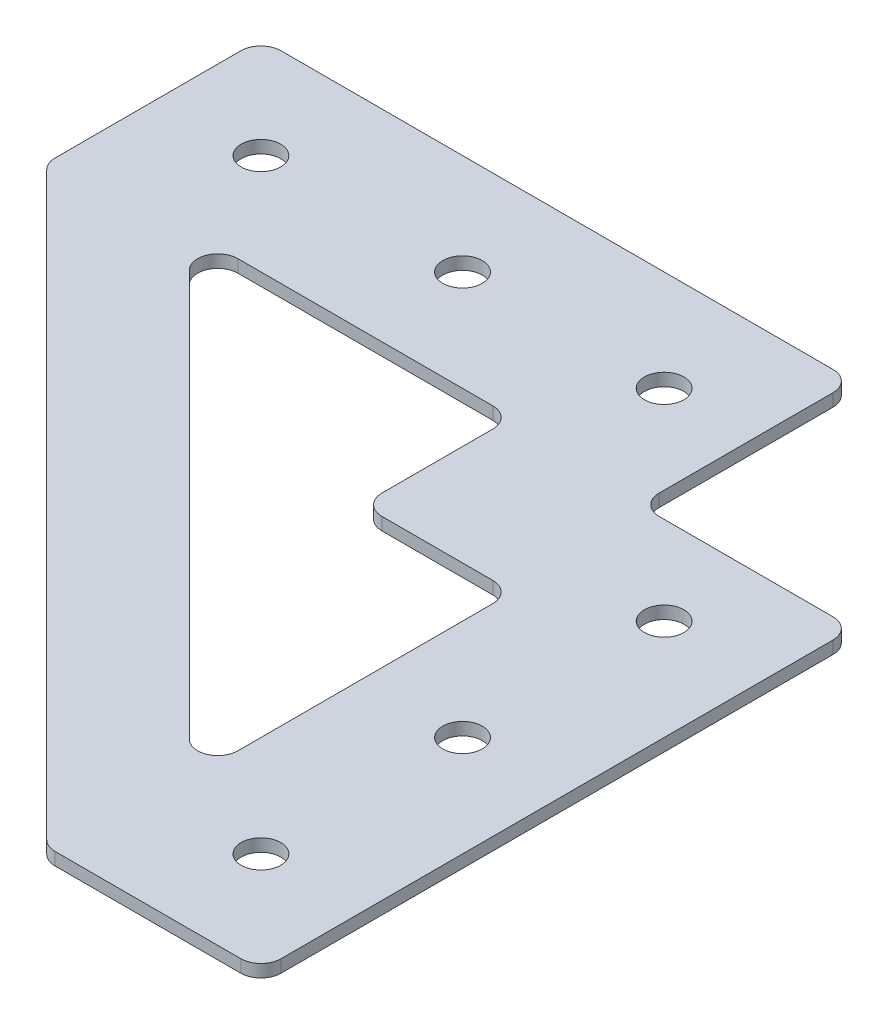
ISO-10303-21;
HEADER;
FILE_DESCRIPTION(('STEP AP214'),'2;1');
FILE_NAME('part.step','',(''),(''),'','','');
FILE_SCHEMA(('AUTOMOTIVE_DESIGN { 1 0 10303 214 1 1 1 1 }'));
ENDSEC;
DATA;
#1=APPLICATION_CONTEXT('core data for automotive mechanical design processes');
#2=APPLICATION_PROTOCOL_DEFINITION('international standard','automotive_design',2000,#1);
#3=PRODUCT_CONTEXT('',#1,'mechanical');
#4=PRODUCT('Part','Part','',(#3));
#5=PRODUCT_RELATED_PRODUCT_CATEGORY('part','',(#4));
#6=PRODUCT_DEFINITION_FORMATION('','',#4);
#7=PRODUCT_DEFINITION_CONTEXT('part definition',#1,'design');
#8=PRODUCT_DEFINITION('design','',#6,#7);
#9=PRODUCT_DEFINITION_SHAPE('','',#8);
#10=(LENGTH_UNIT() NAMED_UNIT(*) SI_UNIT(.MILLI.,.METRE.));
#11=(NAMED_UNIT(*) PLANE_ANGLE_UNIT() SI_UNIT($,.RADIAN.));
#12=(NAMED_UNIT(*) SI_UNIT($,.STERADIAN.) SOLID_ANGLE_UNIT());
#13=UNCERTAINTY_MEASURE_WITH_UNIT(LENGTH_MEASURE(1.E-05),#10,'distance_accuracy_value','');
#14=(GEOMETRIC_REPRESENTATION_CONTEXT(3) GLOBAL_UNCERTAINTY_ASSIGNED_CONTEXT((#13)) GLOBAL_UNIT_ASSIGNED_CONTEXT((#10,
#11,#12)) REPRESENTATION_CONTEXT('',''));
#15=CARTESIAN_POINT('',(0.,0.,0.));
#16=DIRECTION('',(0.,0.,1.));
#17=DIRECTION('',(1.,0.,0.));
#18=AXIS2_PLACEMENT_3D('',#15,#16,#17);
#19=CARTESIAN_POINT('',(-12.7,0.,38.1));
#20=DIRECTION('',(0.,1.,0.));
#21=DIRECTION('',(0.,0.,1.));
#22=AXIS2_PLACEMENT_3D('',#19,#20,#21);
#23=CYLINDRICAL_SURFACE('',#22,2.4892);
#24=CARTESIAN_POINT('',(-12.7,0.,38.1));
#25=DIRECTION('',(0.,1.,0.));
#26=DIRECTION('',(0.,0.,1.));
#27=AXIS2_PLACEMENT_3D('',#24,#25,#26);
#28=CIRCLE('',#27,2.4892);
#29=CARTESIAN_POINT('',(-12.7,0.,40.5892));
#30=VERTEX_POINT('',#29);
#31=EDGE_CURVE('E44',#30,#30,#28,.T.);
#32=ORIENTED_EDGE('',*,*,#31,.F.);
#33=EDGE_LOOP('',(#32));
#34=FACE_BOUND('',#33,.T.);
#35=CARTESIAN_POINT('',(-12.7,1.5875,38.1));
#36=DIRECTION('',(0.,1.,0.));
#37=DIRECTION('',(0.,0.,1.));
#38=AXIS2_PLACEMENT_3D('',#35,#36,#37);
#39=CIRCLE('',#38,2.4892);
#40=CARTESIAN_POINT('',(-12.7,1.5875,40.5892));
#41=VERTEX_POINT('',#40);
#42=EDGE_CURVE('E11',#41,#41,#39,.T.);
#43=ORIENTED_EDGE('',*,*,#42,.T.);
#44=EDGE_LOOP('',(#43));
#45=FACE_BOUND('',#44,.T.);
#46=ADVANCED_FACE('F37',(#34,#45),#23,.F.);
#47=CARTESIAN_POINT('',(-12.7,0.,63.5));
#48=DIRECTION('',(0.,1.,0.));
#49=DIRECTION('',(0.,0.,1.));
#50=AXIS2_PLACEMENT_3D('',#47,#48,#49);
#51=CYLINDRICAL_SURFACE('',#50,2.4892);
#52=CARTESIAN_POINT('',(-12.7,0.,63.5));
#53=DIRECTION('',(0.,1.,0.));
#54=DIRECTION('',(0.,0.,1.));
#55=AXIS2_PLACEMENT_3D('',#52,#53,#54);
#56=CIRCLE('',#55,2.4892);
#57=CARTESIAN_POINT('',(-12.7,0.,65.9892));
#58=VERTEX_POINT('',#57);
#59=EDGE_CURVE('E343',#58,#58,#56,.T.);
#60=ORIENTED_EDGE('',*,*,#59,.F.);
#61=EDGE_LOOP('',(#60));
#62=FACE_BOUND('',#61,.T.);
#63=CARTESIAN_POINT('',(-12.7,1.5875,63.5));
#64=DIRECTION('',(0.,1.,0.));
#65=DIRECTION('',(0.,0.,1.));
#66=AXIS2_PLACEMENT_3D('',#63,#64,#65);
#67=CIRCLE('',#66,2.4892);
#68=CARTESIAN_POINT('',(-12.7,1.5875,65.9892));
#69=VERTEX_POINT('',#68);
#70=EDGE_CURVE('E346',#69,#69,#67,.T.);
#71=ORIENTED_EDGE('',*,*,#70,.T.);
#72=EDGE_LOOP('',(#71));
#73=FACE_BOUND('',#72,.T.);
#74=ADVANCED_FACE('F355',(#62,#73),#51,.F.);
#75=CARTESIAN_POINT('',(-38.1,0.,12.7));
#76=DIRECTION('',(0.,1.,0.));
#77=DIRECTION('',(0.,0.,1.));
#78=AXIS2_PLACEMENT_3D('',#75,#76,#77);
#79=CYLINDRICAL_SURFACE('',#78,2.4892);
#80=CARTESIAN_POINT('',(-38.1,0.,12.7));
#81=DIRECTION('',(0.,1.,0.));
#82=DIRECTION('',(0.,0.,1.));
#83=AXIS2_PLACEMENT_3D('',#80,#81,#82);
#84=CIRCLE('',#83,2.4892);
#85=CARTESIAN_POINT('',(-38.1,0.,15.1892));
#86=VERTEX_POINT('',#85);
#87=EDGE_CURVE('E337',#86,#86,#84,.T.);
#88=ORIENTED_EDGE('',*,*,#87,.F.);
#89=EDGE_LOOP('',(#88));
#90=FACE_BOUND('',#89,.T.);
#91=CARTESIAN_POINT('',(-38.1,1.5875,12.7));
#92=DIRECTION('',(0.,1.,0.));
#93=DIRECTION('',(0.,0.,1.));
#94=AXIS2_PLACEMENT_3D('',#91,#92,#93);
#95=CIRCLE('',#94,2.4892);
#96=CARTESIAN_POINT('',(-38.1,1.5875,15.1892));
#97=VERTEX_POINT('',#96);
#98=EDGE_CURVE('E340',#97,#97,#95,.T.);
#99=ORIENTED_EDGE('',*,*,#98,.T.);
#100=EDGE_LOOP('',(#99));
#101=FACE_BOUND('',#100,.T.);
#102=ADVANCED_FACE('F549',(#90,#101),#79,.F.);
#103=CARTESIAN_POINT('',(-63.5,0.,12.7));
#104=DIRECTION('',(0.,1.,0.));
#105=DIRECTION('',(0.,0.,1.));
#106=AXIS2_PLACEMENT_3D('',#103,#104,#105);
#107=CYLINDRICAL_SURFACE('',#106,2.4892);
#108=CARTESIAN_POINT('',(-63.5,0.,12.7));
#109=DIRECTION('',(0.,1.,0.));
#110=DIRECTION('',(0.,0.,1.));
#111=AXIS2_PLACEMENT_3D('',#108,#109,#110);
#112=CIRCLE('',#111,2.4892);
#113=CARTESIAN_POINT('',(-63.5,0.,15.1892));
#114=VERTEX_POINT('',#113);
#115=EDGE_CURVE('E331',#114,#114,#112,.T.);
#116=ORIENTED_EDGE('',*,*,#115,.F.);
#117=EDGE_LOOP('',(#116));
#118=FACE_BOUND('',#117,.T.);
#119=CARTESIAN_POINT('',(-63.5,1.5875,12.7));
#120=DIRECTION('',(0.,1.,0.));
#121=DIRECTION('',(0.,0.,1.));
#122=AXIS2_PLACEMENT_3D('',#119,#120,#121);
#123=CIRCLE('',#122,2.4892);
#124=CARTESIAN_POINT('',(-63.5,1.5875,15.1892));
#125=VERTEX_POINT('',#124);
#126=EDGE_CURVE('E334',#125,#125,#123,.T.);
#127=ORIENTED_EDGE('',*,*,#126,.T.);
#128=EDGE_LOOP('',(#127));
#129=FACE_BOUND('',#128,.T.);
#130=ADVANCED_FACE('F361',(#118,#129),#107,.F.);
#131=CARTESIAN_POINT('',(0.,1.5875,0.));
#132=DIRECTION('',(0.,-1.,0.));
#133=DIRECTION('',(0.,0.,-1.));
#134=AXIS2_PLACEMENT_3D('',#131,#132,#133);
#135=PLANE('',#134);
#136=ORIENTED_EDGE('',*,*,#42,.F.);
#137=EDGE_LOOP('',(#136));
#138=FACE_BOUND('',#137,.T.);
#139=ORIENTED_EDGE('',*,*,#70,.F.);
#140=EDGE_LOOP('',(#139));
#141=FACE_BOUND('',#140,.T.);
#142=ORIENTED_EDGE('',*,*,#98,.F.);
#143=EDGE_LOOP('',(#142));
#144=FACE_BOUND('',#143,.T.);
#145=ORIENTED_EDGE('',*,*,#126,.F.);
#146=EDGE_LOOP('',(#145));
#147=FACE_BOUND('',#146,.T.);
#148=CARTESIAN_POINT('',(-88.9,1.5875,12.7));
#149=DIRECTION('',(0.,1.,0.));
#150=DIRECTION('',(0.,0.,1.));
#151=AXIS2_PLACEMENT_3D('',#148,#149,#150);
#152=CIRCLE('',#151,2.4892);
#153=CARTESIAN_POINT('',(-88.9,1.5875,15.1892));
#154=VERTEX_POINT('',#153);
#155=EDGE_CURVE('E372',#154,#154,#152,.T.);
#156=ORIENTED_EDGE('',*,*,#155,.F.);
#157=EDGE_LOOP('',(#156));
#158=FACE_BOUND('',#157,.T.);
#159=CARTESIAN_POINT('',(-12.7,1.5875,88.9));
#160=DIRECTION('',(0.,1.,0.));
#161=DIRECTION('',(0.,0.,1.));
#162=AXIS2_PLACEMENT_3D('',#159,#160,#161);
#163=CIRCLE('',#162,2.4892);
#164=CARTESIAN_POINT('',(-12.7,1.5875,91.3892));
#165=VERTEX_POINT('',#164);
#166=EDGE_CURVE('E375',#165,#165,#163,.T.);
#167=ORIENTED_EDGE('',*,*,#166,.F.);
#168=EDGE_LOOP('',(#167));
#169=FACE_BOUND('',#168,.T.);
#170=DIRECTION('',(0.,0.,-1.));
#171=VECTOR('',#170,1.);
#172=CARTESIAN_POINT('',(0.,1.5875,26.9875));
#173=LINE('',#172,#171);
#174=CARTESIAN_POINT('',(0.,1.5875,99.06));
#175=VERTEX_POINT('',#174);
#176=CARTESIAN_POINT('',(0.,1.5875,29.5275));
#177=VERTEX_POINT('',#176);
#178=EDGE_CURVE('E230',#175,#177,#173,.T.);
#179=ORIENTED_EDGE('',*,*,#178,.T.);
#180=CARTESIAN_POINT('',(-2.54,1.5875,29.5275));
#181=DIRECTION('',(0.,-1.,0.));
#182=DIRECTION('',(0.,0.,-1.));
#183=AXIS2_PLACEMENT_3D('',#180,#181,#182);
#184=CIRCLE('',#183,2.54);
#185=CARTESIAN_POINT('',(-2.54,1.5875,26.9875));
#186=VERTEX_POINT('',#185);
#187=EDGE_CURVE('E58',#177,#186,#184,.F.);
#188=ORIENTED_EDGE('',*,*,#187,.T.);
#189=DIRECTION('',(-1.,0.,0.));
#190=VECTOR('',#189,1.);
#191=CARTESIAN_POINT('',(0.,1.5875,26.9875));
#192=LINE('',#191,#190);
#193=CARTESIAN_POINT('',(-24.4475,1.5875,26.9875));
#194=VERTEX_POINT('',#193);
#195=EDGE_CURVE('E226',#186,#194,#192,.T.);
#196=ORIENTED_EDGE('',*,*,#195,.T.);
#197=CARTESIAN_POINT('',(-24.4475,1.5875,24.4475));
#198=DIRECTION('',(0.,-1.,0.));
#199=DIRECTION('',(0.,0.,-1.));
#200=AXIS2_PLACEMENT_3D('',#197,#198,#199);
#201=CIRCLE('',#200,2.54);
#202=CARTESIAN_POINT('',(-26.9875,1.5875,24.4475));
#203=VERTEX_POINT('',#202);
#204=EDGE_CURVE('E329',#194,#203,#201,.T.);
#205=ORIENTED_EDGE('',*,*,#204,.T.);
#206=DIRECTION('',(0.,0.,-1.));
#207=VECTOR('',#206,1.);
#208=CARTESIAN_POINT('',(-26.9875,1.5875,0.));
#209=LINE('',#208,#207);
#210=CARTESIAN_POINT('',(-26.9875,1.5875,2.54));
#211=VERTEX_POINT('',#210);
#212=EDGE_CURVE('E405',#203,#211,#209,.T.);
#213=ORIENTED_EDGE('',*,*,#212,.T.);
#214=CARTESIAN_POINT('',(-29.5275,1.5875,2.54));
#215=DIRECTION('',(0.,-1.,0.));
#216=DIRECTION('',(0.,0.,-1.));
#217=AXIS2_PLACEMENT_3D('',#214,#215,#216);
#218=CIRCLE('',#217,2.54);
#219=CARTESIAN_POINT('',(-29.5275,1.5875,0.));
#220=VERTEX_POINT('',#219);
#221=EDGE_CURVE('E270',#211,#220,#218,.F.);
#222=ORIENTED_EDGE('',*,*,#221,.T.);
#223=DIRECTION('',(-1.,0.,0.));
#224=VECTOR('',#223,1.);
#225=CARTESIAN_POINT('',(-26.9875,1.5875,0.));
#226=LINE('',#225,#224);
#227=CARTESIAN_POINT('',(-99.06,1.5875,0.));
#228=VERTEX_POINT('',#227);
#229=EDGE_CURVE('E408',#220,#228,#226,.T.);
#230=ORIENTED_EDGE('',*,*,#229,.T.);
#231=CARTESIAN_POINT('',(-99.06,1.5875,2.54));
#232=DIRECTION('',(0.,-1.,0.));
#233=DIRECTION('',(0.,0.,-1.));
#234=AXIS2_PLACEMENT_3D('',#231,#232,#233);
#235=CIRCLE('',#234,2.54);
#236=CARTESIAN_POINT('',(-101.6,1.5875,2.54));
#237=VERTEX_POINT('',#236);
#238=EDGE_CURVE('E272',#228,#237,#235,.F.);
#239=ORIENTED_EDGE('',*,*,#238,.T.);
#240=DIRECTION('',(0.,0.,1.));
#241=VECTOR('',#240,1.);
#242=CARTESIAN_POINT('',(-101.6,1.5875,0.));
#243=LINE('',#242,#241);
#244=CARTESIAN_POINT('',(-101.6,1.5875,25.9353975515723));
#245=VERTEX_POINT('',#244);
#246=EDGE_CURVE('E411',#237,#245,#243,.T.);
#247=ORIENTED_EDGE('',*,*,#246,.T.);
#248=CARTESIAN_POINT('',(-99.06,1.5875,25.9353975515723));
#249=DIRECTION('',(0.,-1.,0.));
#250=DIRECTION('',(0.,0.,-1.));
#251=AXIS2_PLACEMENT_3D('',#248,#249,#250);
#252=CIRCLE('',#251,2.54);
#253=CARTESIAN_POINT('',(-100.856051224214,1.5875,27.7314487757862));
#254=VERTEX_POINT('',#253);
#255=EDGE_CURVE('E274',#245,#254,#252,.F.);
#256=ORIENTED_EDGE('',*,*,#255,.T.);
#257=DIRECTION('',(0.707106781186548,0.,0.707106781186547));
#258=VECTOR('',#257,1.);
#259=CARTESIAN_POINT('',(-101.6,1.5875,26.9875));
#260=LINE('',#259,#258);
#261=CARTESIAN_POINT('',(-27.7314487757861,1.5875,100.856051224214));
#262=VERTEX_POINT('',#261);
#263=EDGE_CURVE('E414',#254,#262,#260,.T.);
#264=ORIENTED_EDGE('',*,*,#263,.T.);
#265=CARTESIAN_POINT('',(-25.9353975515723,1.5875,99.06));
#266=DIRECTION('',(0.,-1.,0.));
#267=DIRECTION('',(0.,0.,-1.));
#268=AXIS2_PLACEMENT_3D('',#265,#266,#267);
#269=CIRCLE('',#268,2.54);
#270=CARTESIAN_POINT('',(-25.9353975515723,1.5875,101.6));
#271=VERTEX_POINT('',#270);
#272=EDGE_CURVE('E276',#262,#271,#269,.F.);
#273=ORIENTED_EDGE('',*,*,#272,.T.);
#274=DIRECTION('',(1.,0.,0.));
#275=VECTOR('',#274,1.);
#276=CARTESIAN_POINT('',(0.,1.5875,101.6));
#277=LINE('',#276,#275);
#278=CARTESIAN_POINT('',(-2.53999999999999,1.5875,101.6));
#279=VERTEX_POINT('',#278);
#280=EDGE_CURVE('E417',#271,#279,#277,.T.);
#281=ORIENTED_EDGE('',*,*,#280,.T.);
#282=CARTESIAN_POINT('',(-2.53999999999999,1.5875,99.06));
#283=DIRECTION('',(0.,-1.,0.));
#284=DIRECTION('',(0.,0.,-1.));
#285=AXIS2_PLACEMENT_3D('',#282,#283,#284);
#286=CIRCLE('',#285,2.54);
#287=EDGE_CURVE('E268',#279,#175,#286,.F.);
#288=ORIENTED_EDGE('',*,*,#287,.T.);
#289=EDGE_LOOP('',(#179,#188,#196,#205,#213,#222,#230,#239,#247,#256,#264,#273,#281,#288));
#290=FACE_BOUND('',#289,.T.);
#291=DIRECTION('',(0.,0.,-1.));
#292=VECTOR('',#291,1.);
#293=CARTESIAN_POINT('',(-44.45,1.5875,25.4));
#294=LINE('',#293,#292);
#295=CARTESIAN_POINT('',(-44.45,1.5875,41.91));
#296=VERTEX_POINT('',#295);
#297=CARTESIAN_POINT('',(-44.45,1.5875,27.94));
#298=VERTEX_POINT('',#297);
#299=EDGE_CURVE('E380',#296,#298,#294,.T.);
#300=ORIENTED_EDGE('',*,*,#299,.F.);
#301=CARTESIAN_POINT('',(-41.91,1.5875,41.91));
#302=DIRECTION('',(0.,-1.,0.));
#303=DIRECTION('',(0.,0.,-1.));
#304=AXIS2_PLACEMENT_3D('',#301,#302,#303);
#305=CIRCLE('',#304,2.54);
#306=CARTESIAN_POINT('',(-41.91,1.5875,44.45));
#307=VERTEX_POINT('',#306);
#308=EDGE_CURVE('E279',#296,#307,#305,.F.);
#309=ORIENTED_EDGE('',*,*,#308,.T.);
#310=DIRECTION('',(-1.,0.,0.));
#311=VECTOR('',#310,1.);
#312=CARTESIAN_POINT('',(-25.4,1.5875,44.45));
#313=LINE('',#312,#311);
#314=CARTESIAN_POINT('',(-27.94,1.5875,44.45));
#315=VERTEX_POINT('',#314);
#316=EDGE_CURVE('E386',#315,#307,#313,.T.);
#317=ORIENTED_EDGE('',*,*,#316,.F.);
#318=CARTESIAN_POINT('',(-27.94,1.5875,46.99));
#319=DIRECTION('',(0.,-1.,0.));
#320=DIRECTION('',(0.,0.,-1.));
#321=AXIS2_PLACEMENT_3D('',#318,#319,#320);
#322=CIRCLE('',#321,2.54);
#323=CARTESIAN_POINT('',(-25.4,1.5875,46.99));
#324=VERTEX_POINT('',#323);
#325=EDGE_CURVE('E211',#315,#324,#322,.T.);
#326=ORIENTED_EDGE('',*,*,#325,.T.);
#327=DIRECTION('',(0.,0.,-1.));
#328=VECTOR('',#327,1.);
#329=CARTESIAN_POINT('',(-25.4,1.5875,44.45));
#330=LINE('',#329,#328);
#331=CARTESIAN_POINT('',(-25.4,1.5875,79.094885309434));
#332=VERTEX_POINT('',#331);
#333=EDGE_CURVE('E580',#332,#324,#330,.T.);
#334=ORIENTED_EDGE('',*,*,#333,.F.);
#335=CARTESIAN_POINT('',(-27.94,1.5875,79.094885309434));
#336=DIRECTION('',(0.,-1.,0.));
#337=DIRECTION('',(0.,0.,-1.));
#338=AXIS2_PLACEMENT_3D('',#335,#336,#337);
#339=CIRCLE('',#338,2.54);
#340=CARTESIAN_POINT('',(-29.7360512242138,1.5875,80.8909365336479));
#341=VERTEX_POINT('',#340);
#342=EDGE_CURVE('E321',#332,#341,#339,.T.);
#343=ORIENTED_EDGE('',*,*,#342,.T.);
#344=DIRECTION('',(0.707106781186548,0.,0.707106781186547));
#345=VECTOR('',#344,1.);
#346=CARTESIAN_POINT('',(-85.2269877578617,1.5875,25.4));
#347=LINE('',#346,#345);
#348=CARTESIAN_POINT('',(-80.8909365336479,1.5875,29.7360512242138));
#349=VERTEX_POINT('',#348);
#350=EDGE_CURVE('E577',#349,#341,#347,.T.);
#351=ORIENTED_EDGE('',*,*,#350,.F.);
#352=CARTESIAN_POINT('',(-79.094885309434,1.5875,27.94));
#353=DIRECTION('',(0.,-1.,0.));
#354=DIRECTION('',(0.,0.,-1.));
#355=AXIS2_PLACEMENT_3D('',#352,#353,#354);
#356=CIRCLE('',#355,2.54);
#357=CARTESIAN_POINT('',(-79.094885309434,1.5875,25.4));
#358=VERTEX_POINT('',#357);
#359=EDGE_CURVE('E317',#349,#358,#356,.T.);
#360=ORIENTED_EDGE('',*,*,#359,.T.);
#361=DIRECTION('',(-1.,0.,0.));
#362=VECTOR('',#361,1.);
#363=CARTESIAN_POINT('',(-44.45,1.5875,25.4));
#364=LINE('',#363,#362);
#365=CARTESIAN_POINT('',(-46.99,1.5875,25.4));
#366=VERTEX_POINT('',#365);
#367=EDGE_CURVE('E400',#366,#358,#364,.T.);
#368=ORIENTED_EDGE('',*,*,#367,.F.);
#369=CARTESIAN_POINT('',(-46.99,1.5875,27.94));
#370=DIRECTION('',(0.,-1.,0.));
#371=DIRECTION('',(0.,0.,-1.));
#372=AXIS2_PLACEMENT_3D('',#369,#370,#371);
#373=CIRCLE('',#372,2.54);
#374=EDGE_CURVE('E210',#366,#298,#373,.T.);
#375=ORIENTED_EDGE('',*,*,#374,.T.);
#376=EDGE_LOOP('',(#300,#309,#317,#326,#334,#343,#351,#360,#368,#375));
#377=FACE_BOUND('',#376,.T.);
#378=ADVANCED_FACE('F358',(#138,#141,#144,#147,#158,#169,#290,#377),#135,.F.);
#379=CARTESIAN_POINT('',(0.,0.,0.));
#380=DIRECTION('',(0.,-1.,0.));
#381=DIRECTION('',(0.,0.,-1.));
#382=AXIS2_PLACEMENT_3D('',#379,#380,#381);
#383=PLANE('',#382);
#384=ORIENTED_EDGE('',*,*,#31,.T.);
#385=EDGE_LOOP('',(#384));
#386=FACE_BOUND('',#385,.T.);
#387=ORIENTED_EDGE('',*,*,#59,.T.);
#388=EDGE_LOOP('',(#387));
#389=FACE_BOUND('',#388,.T.);
#390=ORIENTED_EDGE('',*,*,#87,.T.);
#391=EDGE_LOOP('',(#390));
#392=FACE_BOUND('',#391,.T.);
#393=ORIENTED_EDGE('',*,*,#115,.T.);
#394=EDGE_LOOP('',(#393));
#395=FACE_BOUND('',#394,.T.);
#396=CARTESIAN_POINT('',(-88.9,0.,12.7));
#397=DIRECTION('',(0.,1.,0.));
#398=DIRECTION('',(0.,0.,1.));
#399=AXIS2_PLACEMENT_3D('',#396,#397,#398);
#400=CIRCLE('',#399,2.4892);
#401=CARTESIAN_POINT('',(-88.9,0.,15.1892));
#402=VERTEX_POINT('',#401);
#403=EDGE_CURVE('E222',#402,#402,#400,.T.);
#404=ORIENTED_EDGE('',*,*,#403,.T.);
#405=EDGE_LOOP('',(#404));
#406=FACE_BOUND('',#405,.T.);
#407=CARTESIAN_POINT('',(-12.7,0.,88.9));
#408=DIRECTION('',(0.,1.,0.));
#409=DIRECTION('',(0.,0.,1.));
#410=AXIS2_PLACEMENT_3D('',#407,#408,#409);
#411=CIRCLE('',#410,2.4892);
#412=CARTESIAN_POINT('',(-12.7,0.,91.3892));
#413=VERTEX_POINT('',#412);
#414=EDGE_CURVE('E569',#413,#413,#411,.T.);
#415=ORIENTED_EDGE('',*,*,#414,.T.);
#416=EDGE_LOOP('',(#415));
#417=FACE_BOUND('',#416,.T.);
#418=DIRECTION('',(-1.,0.,0.));
#419=VECTOR('',#418,1.);
#420=CARTESIAN_POINT('',(0.,0.,26.9875));
#421=LINE('',#420,#419);
#422=CARTESIAN_POINT('',(-2.54,0.,26.9875));
#423=VERTEX_POINT('',#422);
#424=CARTESIAN_POINT('',(-24.4475,0.,26.9875));
#425=VERTEX_POINT('',#424);
#426=EDGE_CURVE('E233',#423,#425,#421,.T.);
#427=ORIENTED_EDGE('',*,*,#426,.F.);
#428=CARTESIAN_POINT('',(-2.54,0.,29.5275));
#429=DIRECTION('',(0.,-1.,0.));
#430=DIRECTION('',(0.,0.,-1.));
#431=AXIS2_PLACEMENT_3D('',#428,#429,#430);
#432=CIRCLE('',#431,2.54);
#433=CARTESIAN_POINT('',(0.,0.,29.5275));
#434=VERTEX_POINT('',#433);
#435=EDGE_CURVE('E260',#423,#434,#432,.T.);
#436=ORIENTED_EDGE('',*,*,#435,.T.);
#437=DIRECTION('',(0.,0.,-1.));
#438=VECTOR('',#437,1.);
#439=CARTESIAN_POINT('',(0.,0.,26.9875));
#440=LINE('',#439,#438);
#441=CARTESIAN_POINT('',(0.,0.,99.06));
#442=VERTEX_POINT('',#441);
#443=EDGE_CURVE('E434',#442,#434,#440,.T.);
#444=ORIENTED_EDGE('',*,*,#443,.F.);
#445=CARTESIAN_POINT('',(-2.53999999999999,0.,99.06));
#446=DIRECTION('',(0.,-1.,0.));
#447=DIRECTION('',(0.,0.,-1.));
#448=AXIS2_PLACEMENT_3D('',#445,#446,#447);
#449=CIRCLE('',#448,2.54);
#450=CARTESIAN_POINT('',(-2.53999999999999,0.,101.6));
#451=VERTEX_POINT('',#450);
#452=EDGE_CURVE('E250',#442,#451,#449,.T.);
#453=ORIENTED_EDGE('',*,*,#452,.T.);
#454=DIRECTION('',(1.,0.,0.));
#455=VECTOR('',#454,1.);
#456=CARTESIAN_POINT('',(0.,0.,101.6));
#457=LINE('',#456,#455);
#458=CARTESIAN_POINT('',(-25.9353975515723,0.,101.6));
#459=VERTEX_POINT('',#458);
#460=EDGE_CURVE('E432',#459,#451,#457,.T.);
#461=ORIENTED_EDGE('',*,*,#460,.F.);
#462=CARTESIAN_POINT('',(-25.9353975515723,0.,99.06));
#463=DIRECTION('',(0.,-1.,0.));
#464=DIRECTION('',(0.,0.,-1.));
#465=AXIS2_PLACEMENT_3D('',#462,#463,#464);
#466=CIRCLE('',#465,2.54);
#467=CARTESIAN_POINT('',(-27.7314487757861,0.,100.856051224214));
#468=VERTEX_POINT('',#467);
#469=EDGE_CURVE('E258',#459,#468,#466,.T.);
#470=ORIENTED_EDGE('',*,*,#469,.T.);
#471=DIRECTION('',(0.707106781186548,0.,0.707106781186547));
#472=VECTOR('',#471,1.);
#473=CARTESIAN_POINT('',(-101.6,0.,26.9875));
#474=LINE('',#473,#472);
#475=CARTESIAN_POINT('',(-100.856051224214,0.,27.7314487757862));
#476=VERTEX_POINT('',#475);
#477=EDGE_CURVE('E429',#476,#468,#474,.T.);
#478=ORIENTED_EDGE('',*,*,#477,.F.);
#479=CARTESIAN_POINT('',(-99.06,0.,25.9353975515723));
#480=DIRECTION('',(0.,-1.,0.));
#481=DIRECTION('',(0.,0.,-1.));
#482=AXIS2_PLACEMENT_3D('',#479,#480,#481);
#483=CIRCLE('',#482,2.54);
#484=CARTESIAN_POINT('',(-101.6,0.,25.9353975515723));
#485=VERTEX_POINT('',#484);
#486=EDGE_CURVE('E256',#476,#485,#483,.T.);
#487=ORIENTED_EDGE('',*,*,#486,.T.);
#488=DIRECTION('',(0.,0.,1.));
#489=VECTOR('',#488,1.);
#490=CARTESIAN_POINT('',(-101.6,0.,0.));
#491=LINE('',#490,#489);
#492=CARTESIAN_POINT('',(-101.6,0.,2.54));
#493=VERTEX_POINT('',#492);
#494=EDGE_CURVE('E426',#493,#485,#491,.T.);
#495=ORIENTED_EDGE('',*,*,#494,.F.);
#496=CARTESIAN_POINT('',(-99.06,0.,2.54));
#497=DIRECTION('',(0.,-1.,0.));
#498=DIRECTION('',(0.,0.,-1.));
#499=AXIS2_PLACEMENT_3D('',#496,#497,#498);
#500=CIRCLE('',#499,2.54);
#501=CARTESIAN_POINT('',(-99.06,0.,0.));
#502=VERTEX_POINT('',#501);
#503=EDGE_CURVE('E254',#493,#502,#500,.T.);
#504=ORIENTED_EDGE('',*,*,#503,.T.);
#505=DIRECTION('',(-1.,0.,0.));
#506=VECTOR('',#505,1.);
#507=CARTESIAN_POINT('',(-26.9875,0.,0.));
#508=LINE('',#507,#506);
#509=CARTESIAN_POINT('',(-29.5275,0.,0.));
#510=VERTEX_POINT('',#509);
#511=EDGE_CURVE('E423',#510,#502,#508,.T.);
#512=ORIENTED_EDGE('',*,*,#511,.F.);
#513=CARTESIAN_POINT('',(-29.5275,0.,2.54));
#514=DIRECTION('',(0.,-1.,0.));
#515=DIRECTION('',(0.,0.,-1.));
#516=AXIS2_PLACEMENT_3D('',#513,#514,#515);
#517=CIRCLE('',#516,2.54);
#518=CARTESIAN_POINT('',(-26.9875,0.,2.54));
#519=VERTEX_POINT('',#518);
#520=EDGE_CURVE('E252',#510,#519,#517,.T.);
#521=ORIENTED_EDGE('',*,*,#520,.T.);
#522=DIRECTION('',(0.,0.,-1.));
#523=VECTOR('',#522,1.);
#524=CARTESIAN_POINT('',(-26.9875,0.,0.));
#525=LINE('',#524,#523);
#526=CARTESIAN_POINT('',(-26.9875,0.,24.4475));
#527=VERTEX_POINT('',#526);
#528=EDGE_CURVE('E385',#527,#519,#525,.T.);
#529=ORIENTED_EDGE('',*,*,#528,.F.);
#530=CARTESIAN_POINT('',(-24.4475,0.,24.4475));
#531=DIRECTION('',(0.,-1.,0.));
#532=DIRECTION('',(0.,0.,-1.));
#533=AXIS2_PLACEMENT_3D('',#530,#531,#532);
#534=CIRCLE('',#533,2.54);
#535=EDGE_CURVE('E327',#527,#425,#534,.F.);
#536=ORIENTED_EDGE('',*,*,#535,.T.);
#537=EDGE_LOOP('',(#427,#436,#444,#453,#461,#470,#478,#487,#495,#504,#512,#521,#529,#536));
#538=FACE_BOUND('',#537,.T.);
#539=DIRECTION('',(-1.,0.,0.));
#540=VECTOR('',#539,1.);
#541=CARTESIAN_POINT('',(-25.4,0.,44.45));
#542=LINE('',#541,#540);
#543=CARTESIAN_POINT('',(-27.94,0.,44.45));
#544=VERTEX_POINT('',#543);
#545=CARTESIAN_POINT('',(-41.91,0.,44.45));
#546=VERTEX_POINT('',#545);
#547=EDGE_CURVE('E395',#544,#546,#542,.T.);
#548=ORIENTED_EDGE('',*,*,#547,.T.);
#549=CARTESIAN_POINT('',(-41.91,0.,41.91));
#550=DIRECTION('',(0.,-1.,0.));
#551=DIRECTION('',(0.,0.,-1.));
#552=AXIS2_PLACEMENT_3D('',#549,#550,#551);
#553=CIRCLE('',#552,2.54);
#554=CARTESIAN_POINT('',(-44.45,0.,41.91));
#555=VERTEX_POINT('',#554);
#556=EDGE_CURVE('E262',#546,#555,#553,.T.);
#557=ORIENTED_EDGE('',*,*,#556,.T.);
#558=DIRECTION('',(0.,0.,-1.));
#559=VECTOR('',#558,1.);
#560=CARTESIAN_POINT('',(-44.45,0.,25.4));
#561=LINE('',#560,#559);
#562=CARTESIAN_POINT('',(-44.45,0.,27.94));
#563=VERTEX_POINT('',#562);
#564=EDGE_CURVE('E205',#555,#563,#561,.T.);
#565=ORIENTED_EDGE('',*,*,#564,.T.);
#566=CARTESIAN_POINT('',(-46.99,0.,27.94));
#567=DIRECTION('',(0.,-1.,0.));
#568=DIRECTION('',(0.,0.,-1.));
#569=AXIS2_PLACEMENT_3D('',#566,#567,#568);
#570=CIRCLE('',#569,2.54);
#571=CARTESIAN_POINT('',(-46.99,0.,25.4));
#572=VERTEX_POINT('',#571);
#573=EDGE_CURVE('E199',#563,#572,#570,.F.);
#574=ORIENTED_EDGE('',*,*,#573,.T.);
#575=DIRECTION('',(-1.,0.,0.));
#576=VECTOR('',#575,1.);
#577=CARTESIAN_POINT('',(-44.45,0.,25.4));
#578=LINE('',#577,#576);
#579=CARTESIAN_POINT('',(-79.094885309434,0.,25.4));
#580=VERTEX_POINT('',#579);
#581=EDGE_CURVE('E203',#572,#580,#578,.T.);
#582=ORIENTED_EDGE('',*,*,#581,.T.);
#583=CARTESIAN_POINT('',(-79.094885309434,0.,27.94));
#584=DIRECTION('',(0.,-1.,0.));
#585=DIRECTION('',(0.,0.,-1.));
#586=AXIS2_PLACEMENT_3D('',#583,#584,#585);
#587=CIRCLE('',#586,2.54);
#588=CARTESIAN_POINT('',(-80.8909365336479,0.,29.7360512242138));
#589=VERTEX_POINT('',#588);
#590=EDGE_CURVE('E315',#580,#589,#587,.F.);
#591=ORIENTED_EDGE('',*,*,#590,.T.);
#592=DIRECTION('',(0.707106781186548,0.,0.707106781186547));
#593=VECTOR('',#592,1.);
#594=CARTESIAN_POINT('',(-85.2269877578617,0.,25.4));
#595=LINE('',#594,#593);
#596=CARTESIAN_POINT('',(-29.7360512242138,0.,80.8909365336479));
#597=VERTEX_POINT('',#596);
#598=EDGE_CURVE('E221',#589,#597,#595,.T.);
#599=ORIENTED_EDGE('',*,*,#598,.T.);
#600=CARTESIAN_POINT('',(-27.94,0.,79.094885309434));
#601=DIRECTION('',(0.,-1.,0.));
#602=DIRECTION('',(0.,0.,-1.));
#603=AXIS2_PLACEMENT_3D('',#600,#601,#602);
#604=CIRCLE('',#603,2.54);
#605=CARTESIAN_POINT('',(-25.4,0.,79.094885309434));
#606=VERTEX_POINT('',#605);
#607=EDGE_CURVE('E319',#597,#606,#604,.F.);
#608=ORIENTED_EDGE('',*,*,#607,.T.);
#609=DIRECTION('',(0.,0.,-1.));
#610=VECTOR('',#609,1.);
#611=CARTESIAN_POINT('',(-25.4,0.,44.45));
#612=LINE('',#611,#610);
#613=CARTESIAN_POINT('',(-25.4,0.,46.99));
#614=VERTEX_POINT('',#613);
#615=EDGE_CURVE('E398',#606,#614,#612,.T.);
#616=ORIENTED_EDGE('',*,*,#615,.T.);
#617=CARTESIAN_POINT('',(-27.94,0.,46.99));
#618=DIRECTION('',(0.,-1.,0.));
#619=DIRECTION('',(0.,0.,-1.));
#620=AXIS2_PLACEMENT_3D('',#617,#618,#619);
#621=CIRCLE('',#620,2.54);
#622=EDGE_CURVE('E323',#614,#544,#621,.F.);
#623=ORIENTED_EDGE('',*,*,#622,.T.);
#624=EDGE_LOOP('',(#548,#557,#565,#574,#582,#591,#599,#608,#616,#623));
#625=FACE_BOUND('',#624,.T.);
#626=ADVANCED_FACE('F202',(#386,#389,#392,#395,#406,#417,#538,#625),#383,.T.);
#627=CARTESIAN_POINT('',(-26.9875,1.5875,0.));
#628=DIRECTION('',(-1.,0.,0.));
#629=DIRECTION('',(0.,0.,1.));
#630=AXIS2_PLACEMENT_3D('',#627,#628,#629);
#631=PLANE('',#630);
#632=ORIENTED_EDGE('',*,*,#212,.F.);
#633=DIRECTION('',(0.,-1.,0.));
#634=VECTOR('',#633,1.);
#635=CARTESIAN_POINT('',(-26.9875,0.,24.4475));
#636=LINE('',#635,#634);
#637=EDGE_CURVE('E283',#203,#527,#636,.T.);
#638=ORIENTED_EDGE('',*,*,#637,.T.);
#639=ORIENTED_EDGE('',*,*,#528,.T.);
#640=DIRECTION('',(0.,-1.,0.));
#641=VECTOR('',#640,1.);
#642=CARTESIAN_POINT('',(-26.9875,1.5875,2.54));
#643=LINE('',#642,#641);
#644=EDGE_CURVE('E281',#519,#211,#643,.F.);
#645=ORIENTED_EDGE('',*,*,#644,.T.);
#646=EDGE_LOOP('',(#632,#638,#639,#645));
#647=FACE_BOUND('',#646,.T.);
#648=ADVANCED_FACE('F450',(#647),#631,.F.);
#649=CARTESIAN_POINT('',(-26.9875,1.5875,0.));
#650=DIRECTION('',(0.,0.,1.));
#651=DIRECTION('',(1.,0.,0.));
#652=AXIS2_PLACEMENT_3D('',#649,#650,#651);
#653=PLANE('',#652);
#654=ORIENTED_EDGE('',*,*,#511,.T.);
#655=DIRECTION('',(0.,-1.,0.));
#656=VECTOR('',#655,1.);
#657=CARTESIAN_POINT('',(-99.06,1.5875,0.));
#658=LINE('',#657,#656);
#659=EDGE_CURVE('E313',#502,#228,#658,.F.);
#660=ORIENTED_EDGE('',*,*,#659,.T.);
#661=ORIENTED_EDGE('',*,*,#229,.F.);
#662=DIRECTION('',(0.,-1.,0.));
#663=VECTOR('',#662,1.);
#664=CARTESIAN_POINT('',(-29.5275,1.5875,0.));
#665=LINE('',#664,#663);
#666=EDGE_CURVE('E310',#220,#510,#665,.T.);
#667=ORIENTED_EDGE('',*,*,#666,.T.);
#668=EDGE_LOOP('',(#654,#660,#661,#667));
#669=FACE_BOUND('',#668,.T.);
#670=ADVANCED_FACE('F459',(#669),#653,.F.);
#671=CARTESIAN_POINT('',(-101.6,1.5875,0.));
#672=DIRECTION('',(1.,0.,0.));
#673=DIRECTION('',(0.,0.,-1.));
#674=AXIS2_PLACEMENT_3D('',#671,#672,#673);
#675=PLANE('',#674);
#676=ORIENTED_EDGE('',*,*,#494,.T.);
#677=DIRECTION('',(0.,-1.,0.));
#678=VECTOR('',#677,1.);
#679=CARTESIAN_POINT('',(-101.6,1.5875,25.9353975515723));
#680=LINE('',#679,#678);
#681=EDGE_CURVE('E308',#485,#245,#680,.F.);
#682=ORIENTED_EDGE('',*,*,#681,.T.);
#683=ORIENTED_EDGE('',*,*,#246,.F.);
#684=DIRECTION('',(0.,-1.,0.));
#685=VECTOR('',#684,1.);
#686=CARTESIAN_POINT('',(-101.6,1.5875,2.54));
#687=LINE('',#686,#685);
#688=EDGE_CURVE('E305',#237,#493,#687,.T.);
#689=ORIENTED_EDGE('',*,*,#688,.T.);
#690=EDGE_LOOP('',(#676,#682,#683,#689));
#691=FACE_BOUND('',#690,.T.);
#692=ADVANCED_FACE('F468',(#691),#675,.F.);
#693=CARTESIAN_POINT('',(-101.6,1.5875,26.9875));
#694=DIRECTION('',(0.707106781186547,0.,-0.707106781186548));
#695=DIRECTION('',(-0.707106781186548,0.,-0.707106781186547));
#696=AXIS2_PLACEMENT_3D('',#693,#694,#695);
#697=PLANE('',#696);
#698=ORIENTED_EDGE('',*,*,#477,.T.);
#699=DIRECTION('',(0.,-1.,0.));
#700=VECTOR('',#699,1.);
#701=CARTESIAN_POINT('',(-27.7314487757861,1.5875,100.856051224214));
#702=LINE('',#701,#700);
#703=EDGE_CURVE('E303',#468,#262,#702,.F.);
#704=ORIENTED_EDGE('',*,*,#703,.T.);
#705=ORIENTED_EDGE('',*,*,#263,.F.);
#706=DIRECTION('',(0.,-1.,0.));
#707=VECTOR('',#706,1.);
#708=CARTESIAN_POINT('',(-100.856051224214,1.5875,27.7314487757862));
#709=LINE('',#708,#707);
#710=EDGE_CURVE('E300',#254,#476,#709,.T.);
#711=ORIENTED_EDGE('',*,*,#710,.T.);
#712=EDGE_LOOP('',(#698,#704,#705,#711));
#713=FACE_BOUND('',#712,.T.);
#714=ADVANCED_FACE('F477',(#713),#697,.F.);
#715=CARTESIAN_POINT('',(0.,1.5875,101.6));
#716=DIRECTION('',(0.,0.,-1.));
#717=DIRECTION('',(-1.,0.,0.));
#718=AXIS2_PLACEMENT_3D('',#715,#716,#717);
#719=PLANE('',#718);
#720=ORIENTED_EDGE('',*,*,#280,.F.);
#721=DIRECTION('',(0.,-1.,0.));
#722=VECTOR('',#721,1.);
#723=CARTESIAN_POINT('',(-25.9353975515723,1.5875,101.6));
#724=LINE('',#723,#722);
#725=EDGE_CURVE('E297',#271,#459,#724,.T.);
#726=ORIENTED_EDGE('',*,*,#725,.T.);
#727=ORIENTED_EDGE('',*,*,#460,.T.);
#728=DIRECTION('',(0.,-1.,0.));
#729=VECTOR('',#728,1.);
#730=CARTESIAN_POINT('',(-2.53999999999999,1.5875,101.6));
#731=LINE('',#730,#729);
#732=EDGE_CURVE('E295',#451,#279,#731,.F.);
#733=ORIENTED_EDGE('',*,*,#732,.T.);
#734=EDGE_LOOP('',(#720,#726,#727,#733));
#735=FACE_BOUND('',#734,.T.);
#736=ADVANCED_FACE('F486',(#735),#719,.F.);
#737=CARTESIAN_POINT('',(0.,1.5875,26.9875));
#738=DIRECTION('',(-1.,0.,0.));
#739=DIRECTION('',(0.,0.,1.));
#740=AXIS2_PLACEMENT_3D('',#737,#738,#739);
#741=PLANE('',#740);
#742=ORIENTED_EDGE('',*,*,#443,.T.);
#743=DIRECTION('',(0.,-1.,0.));
#744=VECTOR('',#743,1.);
#745=CARTESIAN_POINT('',(0.,1.5875,29.5275));
#746=LINE('',#745,#744);
#747=EDGE_CURVE('E293',#434,#177,#746,.F.);
#748=ORIENTED_EDGE('',*,*,#747,.T.);
#749=ORIENTED_EDGE('',*,*,#178,.F.);
#750=DIRECTION('',(0.,-1.,0.));
#751=VECTOR('',#750,1.);
#752=CARTESIAN_POINT('',(0.,1.5875,99.06));
#753=LINE('',#752,#751);
#754=EDGE_CURVE('E290',#175,#442,#753,.T.);
#755=ORIENTED_EDGE('',*,*,#754,.T.);
#756=EDGE_LOOP('',(#742,#748,#749,#755));
#757=FACE_BOUND('',#756,.T.);
#758=ADVANCED_FACE('F492',(#757),#741,.F.);
#759=CARTESIAN_POINT('',(0.,1.5875,26.9875));
#760=DIRECTION('',(0.,0.,1.));
#761=DIRECTION('',(1.,0.,0.));
#762=AXIS2_PLACEMENT_3D('',#759,#760,#761);
#763=PLANE('',#762);
#764=ORIENTED_EDGE('',*,*,#426,.T.);
#765=DIRECTION('',(0.,-1.,0.));
#766=VECTOR('',#765,1.);
#767=CARTESIAN_POINT('',(-24.4475,1.5875,26.9875));
#768=LINE('',#767,#766);
#769=EDGE_CURVE('E51',#425,#194,#768,.F.);
#770=ORIENTED_EDGE('',*,*,#769,.T.);
#771=ORIENTED_EDGE('',*,*,#195,.F.);
#772=DIRECTION('',(0.,-1.,0.));
#773=VECTOR('',#772,1.);
#774=CARTESIAN_POINT('',(-2.54,1.5875,26.9875));
#775=LINE('',#774,#773);
#776=EDGE_CURVE('E286',#186,#423,#775,.T.);
#777=ORIENTED_EDGE('',*,*,#776,.T.);
#778=EDGE_LOOP('',(#764,#770,#771,#777));
#779=FACE_BOUND('',#778,.T.);
#780=ADVANCED_FACE('F440',(#779),#763,.F.);
#781=CARTESIAN_POINT('',(-44.45,1.5875,25.4));
#782=DIRECTION('',(0.,0.,1.));
#783=DIRECTION('',(1.,0.,0.));
#784=AXIS2_PLACEMENT_3D('',#781,#782,#783);
#785=PLANE('',#784);
#786=ORIENTED_EDGE('',*,*,#367,.T.);
#787=DIRECTION('',(0.,-1.,0.));
#788=VECTOR('',#787,1.);
#789=CARTESIAN_POINT('',(-79.094885309434,0.,25.4));
#790=LINE('',#789,#788);
#791=EDGE_CURVE('E220',#358,#580,#790,.T.);
#792=ORIENTED_EDGE('',*,*,#791,.T.);
#793=ORIENTED_EDGE('',*,*,#581,.F.);
#794=DIRECTION('',(0.,-1.,0.));
#795=VECTOR('',#794,1.);
#796=CARTESIAN_POINT('',(-46.99,1.5875,25.4));
#797=LINE('',#796,#795);
#798=EDGE_CURVE('E217',#572,#366,#797,.F.);
#799=ORIENTED_EDGE('',*,*,#798,.T.);
#800=EDGE_LOOP('',(#786,#792,#793,#799));
#801=FACE_BOUND('',#800,.T.);
#802=ADVANCED_FACE('F216',(#801),#785,.T.);
#803=CARTESIAN_POINT('',(-85.2269877578617,1.5875,25.4));
#804=DIRECTION('',(0.707106781186547,0.,-0.707106781186548));
#805=DIRECTION('',(-0.707106781186548,0.,-0.707106781186547));
#806=AXIS2_PLACEMENT_3D('',#803,#804,#805);
#807=PLANE('',#806);
#808=ORIENTED_EDGE('',*,*,#598,.F.);
#809=DIRECTION('',(0.,-1.,0.));
#810=VECTOR('',#809,1.);
#811=CARTESIAN_POINT('',(-80.8909365336479,1.5875,29.7360512242138));
#812=LINE('',#811,#810);
#813=EDGE_CURVE('E238',#589,#349,#812,.F.);
#814=ORIENTED_EDGE('',*,*,#813,.T.);
#815=ORIENTED_EDGE('',*,*,#350,.T.);
#816=DIRECTION('',(0.,-1.,0.));
#817=VECTOR('',#816,1.);
#818=CARTESIAN_POINT('',(-29.7360512242138,0.,80.8909365336479));
#819=LINE('',#818,#817);
#820=EDGE_CURVE('E228',#341,#597,#819,.T.);
#821=ORIENTED_EDGE('',*,*,#820,.T.);
#822=EDGE_LOOP('',(#808,#814,#815,#821));
#823=FACE_BOUND('',#822,.T.);
#824=ADVANCED_FACE('F588',(#823),#807,.T.);
#825=CARTESIAN_POINT('',(-25.4,1.5875,44.45));
#826=DIRECTION('',(-1.,0.,0.));
#827=DIRECTION('',(0.,0.,1.));
#828=AXIS2_PLACEMENT_3D('',#825,#826,#827);
#829=PLANE('',#828);
#830=ORIENTED_EDGE('',*,*,#615,.F.);
#831=DIRECTION('',(0.,-1.,0.));
#832=VECTOR('',#831,1.);
#833=CARTESIAN_POINT('',(-25.4,1.5875,79.094885309434));
#834=LINE('',#833,#832);
#835=EDGE_CURVE('E243',#606,#332,#834,.F.);
#836=ORIENTED_EDGE('',*,*,#835,.T.);
#837=ORIENTED_EDGE('',*,*,#333,.T.);
#838=DIRECTION('',(0.,-1.,0.));
#839=VECTOR('',#838,1.);
#840=CARTESIAN_POINT('',(-25.4,0.,46.99));
#841=LINE('',#840,#839);
#842=EDGE_CURVE('E240',#324,#614,#841,.T.);
#843=ORIENTED_EDGE('',*,*,#842,.T.);
#844=EDGE_LOOP('',(#830,#836,#837,#843));
#845=FACE_BOUND('',#844,.T.);
#846=ADVANCED_FACE('F596',(#845),#829,.T.);
#847=CARTESIAN_POINT('',(-25.4,1.5875,44.45));
#848=DIRECTION('',(0.,0.,1.));
#849=DIRECTION('',(1.,0.,0.));
#850=AXIS2_PLACEMENT_3D('',#847,#848,#849);
#851=PLANE('',#850);
#852=ORIENTED_EDGE('',*,*,#547,.F.);
#853=DIRECTION('',(0.,-1.,0.));
#854=VECTOR('',#853,1.);
#855=CARTESIAN_POINT('',(-27.94,1.5875,44.45));
#856=LINE('',#855,#854);
#857=EDGE_CURVE('E248',#544,#315,#856,.F.);
#858=ORIENTED_EDGE('',*,*,#857,.T.);
#859=ORIENTED_EDGE('',*,*,#316,.T.);
#860=DIRECTION('',(0.,-1.,0.));
#861=VECTOR('',#860,1.);
#862=CARTESIAN_POINT('',(-41.91,1.5875,44.45));
#863=LINE('',#862,#861);
#864=EDGE_CURVE('E245',#307,#546,#863,.T.);
#865=ORIENTED_EDGE('',*,*,#864,.T.);
#866=EDGE_LOOP('',(#852,#858,#859,#865));
#867=FACE_BOUND('',#866,.T.);
#868=ADVANCED_FACE('F394',(#867),#851,.T.);
#869=CARTESIAN_POINT('',(-44.45,1.5875,25.4));
#870=DIRECTION('',(-1.,0.,0.));
#871=DIRECTION('',(0.,0.,1.));
#872=AXIS2_PLACEMENT_3D('',#869,#870,#871);
#873=PLANE('',#872);
#874=ORIENTED_EDGE('',*,*,#564,.F.);
#875=DIRECTION('',(0.,-1.,0.));
#876=VECTOR('',#875,1.);
#877=CARTESIAN_POINT('',(-44.45,1.5875,41.91));
#878=LINE('',#877,#876);
#879=EDGE_CURVE('E266',#555,#296,#878,.F.);
#880=ORIENTED_EDGE('',*,*,#879,.T.);
#881=ORIENTED_EDGE('',*,*,#299,.T.);
#882=DIRECTION('',(0.,-1.,0.));
#883=VECTOR('',#882,1.);
#884=CARTESIAN_POINT('',(-44.45,0.,27.94));
#885=LINE('',#884,#883);
#886=EDGE_CURVE('E264',#298,#563,#885,.T.);
#887=ORIENTED_EDGE('',*,*,#886,.T.);
#888=EDGE_LOOP('',(#874,#880,#881,#887));
#889=FACE_BOUND('',#888,.T.);
#890=ADVANCED_FACE('F519',(#889),#873,.T.);
#891=CARTESIAN_POINT('',(-79.094885309434,1.5875,27.94));
#892=DIRECTION('',(0.,1.,0.));
#893=DIRECTION('',(0.,0.,1.));
#894=AXIS2_PLACEMENT_3D('',#891,#892,#893);
#895=CYLINDRICAL_SURFACE('',#894,2.54);
#896=ORIENTED_EDGE('',*,*,#359,.F.);
#897=ORIENTED_EDGE('',*,*,#813,.F.);
#898=ORIENTED_EDGE('',*,*,#590,.F.);
#899=ORIENTED_EDGE('',*,*,#791,.F.);
#900=EDGE_LOOP('',(#896,#897,#898,#899));
#901=FACE_BOUND('',#900,.T.);
#902=ADVANCED_FACE('F515',(#901),#895,.F.);
#903=CARTESIAN_POINT('',(-27.94,1.5875,79.094885309434));
#904=DIRECTION('',(0.,1.,0.));
#905=DIRECTION('',(0.,0.,1.));
#906=AXIS2_PLACEMENT_3D('',#903,#904,#905);
#907=CYLINDRICAL_SURFACE('',#906,2.54);
#908=ORIENTED_EDGE('',*,*,#342,.F.);
#909=ORIENTED_EDGE('',*,*,#835,.F.);
#910=ORIENTED_EDGE('',*,*,#607,.F.);
#911=ORIENTED_EDGE('',*,*,#820,.F.);
#912=EDGE_LOOP('',(#908,#909,#910,#911));
#913=FACE_BOUND('',#912,.T.);
#914=ADVANCED_FACE('F518',(#913),#907,.F.);
#915=CARTESIAN_POINT('',(-27.94,1.5875,46.99));
#916=DIRECTION('',(0.,1.,0.));
#917=DIRECTION('',(0.,0.,1.));
#918=AXIS2_PLACEMENT_3D('',#915,#916,#917);
#919=CYLINDRICAL_SURFACE('',#918,2.54);
#920=ORIENTED_EDGE('',*,*,#325,.F.);
#921=ORIENTED_EDGE('',*,*,#857,.F.);
#922=ORIENTED_EDGE('',*,*,#622,.F.);
#923=ORIENTED_EDGE('',*,*,#842,.F.);
#924=EDGE_LOOP('',(#920,#921,#922,#923));
#925=FACE_BOUND('',#924,.T.);
#926=ADVANCED_FACE('F523',(#925),#919,.F.);
#927=CARTESIAN_POINT('',(-41.91,1.5875,41.91));
#928=DIRECTION('',(0.,-1.,0.));
#929=DIRECTION('',(0.,0.,-1.));
#930=AXIS2_PLACEMENT_3D('',#927,#928,#929);
#931=CYLINDRICAL_SURFACE('',#930,2.54);
#932=ORIENTED_EDGE('',*,*,#308,.F.);
#933=ORIENTED_EDGE('',*,*,#879,.F.);
#934=ORIENTED_EDGE('',*,*,#556,.F.);
#935=ORIENTED_EDGE('',*,*,#864,.F.);
#936=EDGE_LOOP('',(#932,#933,#934,#935));
#937=FACE_BOUND('',#936,.T.);
#938=ADVANCED_FACE('F391',(#937),#931,.T.);
#939=CARTESIAN_POINT('',(-46.99,1.5875,27.94));
#940=DIRECTION('',(0.,1.,0.));
#941=DIRECTION('',(0.,0.,1.));
#942=AXIS2_PLACEMENT_3D('',#939,#940,#941);
#943=CYLINDRICAL_SURFACE('',#942,2.54);
#944=ORIENTED_EDGE('',*,*,#374,.F.);
#945=ORIENTED_EDGE('',*,*,#798,.F.);
#946=ORIENTED_EDGE('',*,*,#573,.F.);
#947=ORIENTED_EDGE('',*,*,#886,.F.);
#948=EDGE_LOOP('',(#944,#945,#946,#947));
#949=FACE_BOUND('',#948,.T.);
#950=ADVANCED_FACE('F225',(#949),#943,.F.);
#951=CARTESIAN_POINT('',(-24.4475,1.5875,24.4475));
#952=DIRECTION('',(0.,1.,0.));
#953=DIRECTION('',(0.,0.,1.));
#954=AXIS2_PLACEMENT_3D('',#951,#952,#953);
#955=CYLINDRICAL_SURFACE('',#954,2.54);
#956=ORIENTED_EDGE('',*,*,#204,.F.);
#957=ORIENTED_EDGE('',*,*,#769,.F.);
#958=ORIENTED_EDGE('',*,*,#535,.F.);
#959=ORIENTED_EDGE('',*,*,#637,.F.);
#960=EDGE_LOOP('',(#956,#957,#958,#959));
#961=FACE_BOUND('',#960,.T.);
#962=ADVANCED_FACE('F445',(#961),#955,.F.);
#963=CARTESIAN_POINT('',(-2.54,1.5875,29.5275));
#964=DIRECTION('',(0.,-1.,0.));
#965=DIRECTION('',(0.,0.,-1.));
#966=AXIS2_PLACEMENT_3D('',#963,#964,#965);
#967=CYLINDRICAL_SURFACE('',#966,2.54);
#968=ORIENTED_EDGE('',*,*,#187,.F.);
#969=ORIENTED_EDGE('',*,*,#747,.F.);
#970=ORIENTED_EDGE('',*,*,#435,.F.);
#971=ORIENTED_EDGE('',*,*,#776,.F.);
#972=EDGE_LOOP('',(#968,#969,#970,#971));
#973=FACE_BOUND('',#972,.T.);
#974=ADVANCED_FACE('F494',(#973),#967,.T.);
#975=CARTESIAN_POINT('',(-25.9353975515723,1.5875,99.06));
#976=DIRECTION('',(0.,-1.,0.));
#977=DIRECTION('',(0.,0.,-1.));
#978=AXIS2_PLACEMENT_3D('',#975,#976,#977);
#979=CYLINDRICAL_SURFACE('',#978,2.54);
#980=ORIENTED_EDGE('',*,*,#272,.F.);
#981=ORIENTED_EDGE('',*,*,#703,.F.);
#982=ORIENTED_EDGE('',*,*,#469,.F.);
#983=ORIENTED_EDGE('',*,*,#725,.F.);
#984=EDGE_LOOP('',(#980,#981,#982,#983));
#985=FACE_BOUND('',#984,.T.);
#986=ADVANCED_FACE('F481',(#985),#979,.T.);
#987=CARTESIAN_POINT('',(-99.06,1.5875,25.9353975515723));
#988=DIRECTION('',(0.,-1.,0.));
#989=DIRECTION('',(0.,0.,-1.));
#990=AXIS2_PLACEMENT_3D('',#987,#988,#989);
#991=CYLINDRICAL_SURFACE('',#990,2.54);
#992=ORIENTED_EDGE('',*,*,#255,.F.);
#993=ORIENTED_EDGE('',*,*,#681,.F.);
#994=ORIENTED_EDGE('',*,*,#486,.F.);
#995=ORIENTED_EDGE('',*,*,#710,.F.);
#996=EDGE_LOOP('',(#992,#993,#994,#995));
#997=FACE_BOUND('',#996,.T.);
#998=ADVANCED_FACE('F472',(#997),#991,.T.);
#999=CARTESIAN_POINT('',(-99.06,1.5875,2.54));
#1000=DIRECTION('',(0.,-1.,0.));
#1001=DIRECTION('',(0.,0.,-1.));
#1002=AXIS2_PLACEMENT_3D('',#999,#1000,#1001);
#1003=CYLINDRICAL_SURFACE('',#1002,2.54);
#1004=ORIENTED_EDGE('',*,*,#238,.F.);
#1005=ORIENTED_EDGE('',*,*,#659,.F.);
#1006=ORIENTED_EDGE('',*,*,#503,.F.);
#1007=ORIENTED_EDGE('',*,*,#688,.F.);
#1008=EDGE_LOOP('',(#1004,#1005,#1006,#1007));
#1009=FACE_BOUND('',#1008,.T.);
#1010=ADVANCED_FACE('F463',(#1009),#1003,.T.);
#1011=CARTESIAN_POINT('',(-29.5275,1.5875,2.54));
#1012=DIRECTION('',(0.,-1.,0.));
#1013=DIRECTION('',(0.,0.,-1.));
#1014=AXIS2_PLACEMENT_3D('',#1011,#1012,#1013);
#1015=CYLINDRICAL_SURFACE('',#1014,2.54);
#1016=ORIENTED_EDGE('',*,*,#221,.F.);
#1017=ORIENTED_EDGE('',*,*,#644,.F.);
#1018=ORIENTED_EDGE('',*,*,#520,.F.);
#1019=ORIENTED_EDGE('',*,*,#666,.F.);
#1020=EDGE_LOOP('',(#1016,#1017,#1018,#1019));
#1021=FACE_BOUND('',#1020,.T.);
#1022=ADVANCED_FACE('F454',(#1021),#1015,.T.);
#1023=CARTESIAN_POINT('',(-2.53999999999999,1.5875,99.06));
#1024=DIRECTION('',(0.,-1.,0.));
#1025=DIRECTION('',(0.,0.,-1.));
#1026=AXIS2_PLACEMENT_3D('',#1023,#1024,#1025);
#1027=CYLINDRICAL_SURFACE('',#1026,2.54);
#1028=ORIENTED_EDGE('',*,*,#287,.F.);
#1029=ORIENTED_EDGE('',*,*,#732,.F.);
#1030=ORIENTED_EDGE('',*,*,#452,.F.);
#1031=ORIENTED_EDGE('',*,*,#754,.F.);
#1032=EDGE_LOOP('',(#1028,#1029,#1030,#1031));
#1033=FACE_BOUND('',#1032,.T.);
#1034=ADVANCED_FACE('F490',(#1033),#1027,.T.);
#1035=CARTESIAN_POINT('',(-12.7,0.,88.9));
#1036=DIRECTION('',(0.,1.,0.));
#1037=DIRECTION('',(0.,0.,1.));
#1038=AXIS2_PLACEMENT_3D('',#1035,#1036,#1037);
#1039=CYLINDRICAL_SURFACE('',#1038,2.4892);
#1040=ORIENTED_EDGE('',*,*,#414,.F.);
#1041=EDGE_LOOP('',(#1040));
#1042=FACE_BOUND('',#1041,.T.);
#1043=ORIENTED_EDGE('',*,*,#166,.T.);
#1044=EDGE_LOOP('',(#1043));
#1045=FACE_BOUND('',#1044,.T.);
#1046=ADVANCED_FACE('F546',(#1042,#1045),#1039,.F.);
#1047=CARTESIAN_POINT('',(-88.9,0.,12.7));
#1048=DIRECTION('',(0.,1.,0.));
#1049=DIRECTION('',(0.,0.,1.));
#1050=AXIS2_PLACEMENT_3D('',#1047,#1048,#1049);
#1051=CYLINDRICAL_SURFACE('',#1050,2.4892);
#1052=ORIENTED_EDGE('',*,*,#403,.F.);
#1053=EDGE_LOOP('',(#1052));
#1054=FACE_BOUND('',#1053,.T.);
#1055=ORIENTED_EDGE('',*,*,#155,.T.);
#1056=EDGE_LOOP('',(#1055));
#1057=FACE_BOUND('',#1056,.T.);
#1058=ADVANCED_FACE('F715',(#1054,#1057),#1051,.F.);
#1059=CLOSED_SHELL('',(#46,#74,#102,#130,#378,#626,#648,#670,#692,#714,#736,#758,#780,#802,#824,
#846,#868,#890,#902,#914,#926,#938,#950,#962,#974,#986,#998,#1010,#1022,#1034,#1046,#1058));
#1060=MANIFOLD_SOLID_BREP('B2',#1059);
#1061=ADVANCED_BREP_SHAPE_REPRESENTATION('',(#18,#1060),#14);
#1062=SHAPE_DEFINITION_REPRESENTATION(#9,#1061);
ENDSEC;
END-ISO-10303-21;
